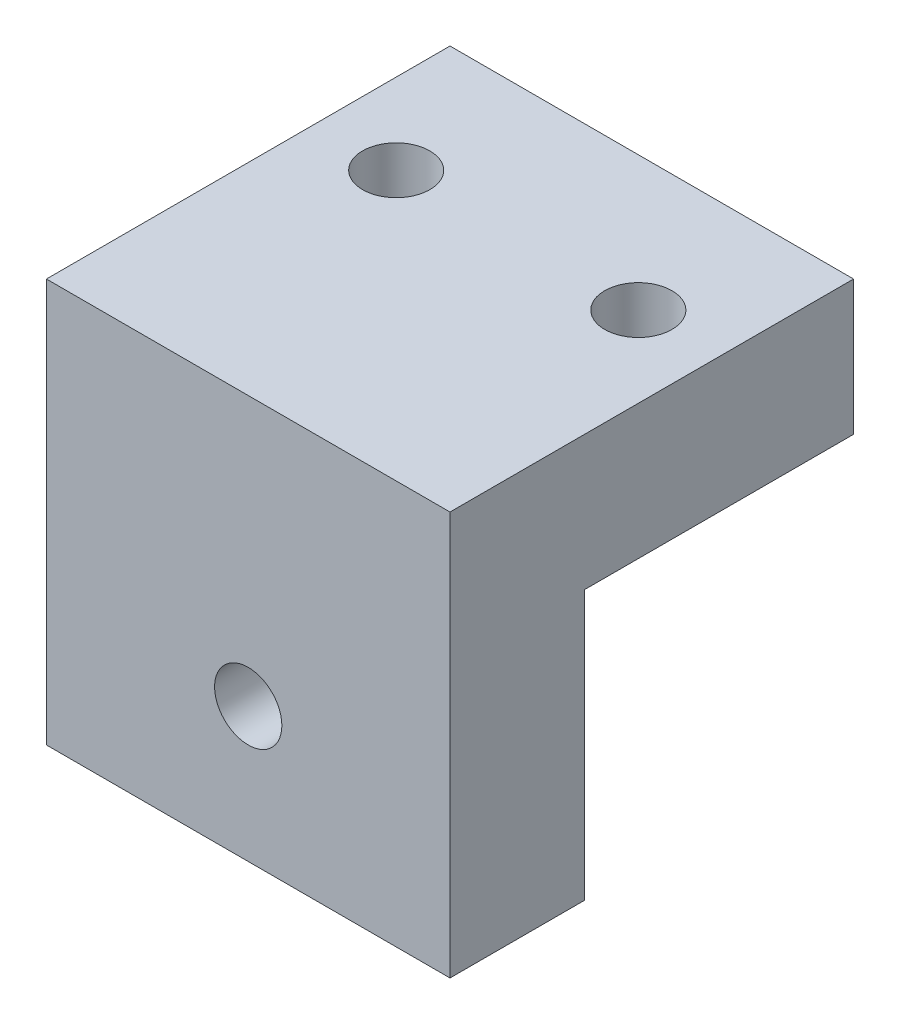
ISO-10303-21;
HEADER;
FILE_DESCRIPTION(('STEP AP214'),'2;1');
FILE_NAME('part.step','',(''),(''),'','','');
FILE_SCHEMA(('AUTOMOTIVE_DESIGN { 1 0 10303 214 1 1 1 1 }'));
ENDSEC;
DATA;
#1=APPLICATION_CONTEXT('core data for automotive mechanical design processes');
#2=APPLICATION_PROTOCOL_DEFINITION('international standard','automotive_design',2000,#1);
#3=PRODUCT_CONTEXT('',#1,'mechanical');
#4=PRODUCT('Part','Part','',(#3));
#5=PRODUCT_RELATED_PRODUCT_CATEGORY('part','',(#4));
#6=PRODUCT_DEFINITION_FORMATION('','',#4);
#7=PRODUCT_DEFINITION_CONTEXT('part definition',#1,'design');
#8=PRODUCT_DEFINITION('design','',#6,#7);
#9=PRODUCT_DEFINITION_SHAPE('','',#8);
#10=(LENGTH_UNIT() NAMED_UNIT(*) SI_UNIT(.MILLI.,.METRE.));
#11=(NAMED_UNIT(*) PLANE_ANGLE_UNIT() SI_UNIT($,.RADIAN.));
#12=(NAMED_UNIT(*) SI_UNIT($,.STERADIAN.) SOLID_ANGLE_UNIT());
#13=UNCERTAINTY_MEASURE_WITH_UNIT(LENGTH_MEASURE(1.E-05),#10,'distance_accuracy_value','');
#14=(GEOMETRIC_REPRESENTATION_CONTEXT(3) GLOBAL_UNCERTAINTY_ASSIGNED_CONTEXT((#13)) GLOBAL_UNIT_ASSIGNED_CONTEXT((#10,
#11,#12)) REPRESENTATION_CONTEXT('',''));
#15=CARTESIAN_POINT('',(0.,0.,0.));
#16=DIRECTION('',(0.,0.,1.));
#17=DIRECTION('',(1.,0.,0.));
#18=AXIS2_PLACEMENT_3D('',#15,#16,#17);
#19=CARTESIAN_POINT('',(0.,10.,0.));
#20=DIRECTION('',(1.,0.,0.));
#21=DIRECTION('',(0.,0.,1.));
#22=AXIS2_PLACEMENT_3D('',#19,#20,#21);
#23=PLANE('',#22);
#24=DIRECTION('',(0.,0.,-1.));
#25=VECTOR('',#24,1.);
#26=CARTESIAN_POINT('',(0.,0.,0.));
#27=LINE('',#26,#25);
#28=CARTESIAN_POINT('',(0.,0.,5.));
#29=VERTEX_POINT('',#28);
#30=CARTESIAN_POINT('',(0.,0.,0.));
#31=VERTEX_POINT('',#30);
#32=EDGE_CURVE('E99',#29,#31,#27,.T.);
#33=ORIENTED_EDGE('',*,*,#32,.F.);
#34=DIRECTION('',(0.,-1.,0.));
#35=VECTOR('',#34,1.);
#36=CARTESIAN_POINT('',(0.,10.,5.));
#37=LINE('',#36,#35);
#38=CARTESIAN_POINT('',(0.,15.,5.));
#39=VERTEX_POINT('',#38);
#40=EDGE_CURVE('E80',#39,#29,#37,.T.);
#41=ORIENTED_EDGE('',*,*,#40,.F.);
#42=DIRECTION('',(0.,0.,-1.));
#43=VECTOR('',#42,1.);
#44=CARTESIAN_POINT('',(0.,15.,5.));
#45=LINE('',#44,#43);
#46=CARTESIAN_POINT('',(0.,15.,-10.));
#47=VERTEX_POINT('',#46);
#48=EDGE_CURVE('E135',#39,#47,#45,.T.);
#49=ORIENTED_EDGE('',*,*,#48,.T.);
#50=DIRECTION('',(0.,-1.,0.));
#51=VECTOR('',#50,1.);
#52=CARTESIAN_POINT('',(0.,15.,-10.));
#53=LINE('',#52,#51);
#54=CARTESIAN_POINT('',(0.,10.,-10.));
#55=VERTEX_POINT('',#54);
#56=EDGE_CURVE('E133',#47,#55,#53,.T.);
#57=ORIENTED_EDGE('',*,*,#56,.T.);
#58=DIRECTION('',(0.,0.,-1.));
#59=VECTOR('',#58,1.);
#60=CARTESIAN_POINT('',(0.,10.,5.));
#61=LINE('',#60,#59);
#62=CARTESIAN_POINT('',(0.,10.,0.));
#63=VERTEX_POINT('',#62);
#64=EDGE_CURVE('E148',#63,#55,#61,.T.);
#65=ORIENTED_EDGE('',*,*,#64,.F.);
#66=DIRECTION('',(0.,-1.,0.));
#67=VECTOR('',#66,1.);
#68=CARTESIAN_POINT('',(0.,10.,0.));
#69=LINE('',#68,#67);
#70=EDGE_CURVE('E12',#63,#31,#69,.T.);
#71=ORIENTED_EDGE('',*,*,#70,.T.);
#72=EDGE_LOOP('',(#33,#41,#49,#57,#65,#71));
#73=FACE_BOUND('',#72,.T.);
#74=ADVANCED_FACE('F40',(#73),#23,.F.);
#75=CARTESIAN_POINT('',(0.,10.,0.));
#76=DIRECTION('',(0.,0.,1.));
#77=DIRECTION('',(-1.,0.,0.));
#78=AXIS2_PLACEMENT_3D('',#75,#76,#77);
#79=PLANE('',#78);
#80=CARTESIAN_POINT('',(7.5,5.,0.));
#81=DIRECTION('',(0.,0.,1.));
#82=DIRECTION('',(1.,0.,0.));
#83=AXIS2_PLACEMENT_3D('',#80,#81,#82);
#84=CIRCLE('',#83,1.25);
#85=CARTESIAN_POINT('',(8.75,5.,0.));
#86=VERTEX_POINT('',#85);
#87=EDGE_CURVE('E152',#86,#86,#84,.T.);
#88=ORIENTED_EDGE('',*,*,#87,.T.);
#89=EDGE_LOOP('',(#88));
#90=FACE_BOUND('',#89,.T.);
#91=DIRECTION('',(1.,0.,0.));
#92=VECTOR('',#91,1.);
#93=CARTESIAN_POINT('',(0.,0.,0.));
#94=LINE('',#93,#92);
#95=CARTESIAN_POINT('',(15.,0.,0.));
#96=VERTEX_POINT('',#95);
#97=EDGE_CURVE('E97',#31,#96,#94,.T.);
#98=ORIENTED_EDGE('',*,*,#97,.F.);
#99=ORIENTED_EDGE('',*,*,#70,.F.);
#100=DIRECTION('',(1.,0.,0.));
#101=VECTOR('',#100,1.);
#102=CARTESIAN_POINT('',(0.,10.,0.));
#103=LINE('',#102,#101);
#104=CARTESIAN_POINT('',(15.,10.,0.));
#105=VERTEX_POINT('',#104);
#106=EDGE_CURVE('E55',#63,#105,#103,.T.);
#107=ORIENTED_EDGE('',*,*,#106,.T.);
#108=DIRECTION('',(0.,-1.,0.));
#109=VECTOR('',#108,1.);
#110=CARTESIAN_POINT('',(15.,10.,0.));
#111=LINE('',#110,#109);
#112=EDGE_CURVE('E48',#105,#96,#111,.T.);
#113=ORIENTED_EDGE('',*,*,#112,.T.);
#114=EDGE_LOOP('',(#98,#99,#107,#113));
#115=FACE_BOUND('',#114,.T.);
#116=ADVANCED_FACE('F104',(#90,#115),#79,.F.);
#117=CARTESIAN_POINT('',(15.,10.,0.));
#118=DIRECTION('',(-1.,0.,0.));
#119=DIRECTION('',(0.,0.,-1.));
#120=AXIS2_PLACEMENT_3D('',#117,#118,#119);
#121=PLANE('',#120);
#122=DIRECTION('',(0.,0.,1.));
#123=VECTOR('',#122,1.);
#124=CARTESIAN_POINT('',(15.,0.,0.));
#125=LINE('',#124,#123);
#126=CARTESIAN_POINT('',(15.,0.,5.));
#127=VERTEX_POINT('',#126);
#128=EDGE_CURVE('E85',#96,#127,#125,.T.);
#129=ORIENTED_EDGE('',*,*,#128,.F.);
#130=ORIENTED_EDGE('',*,*,#112,.F.);
#131=DIRECTION('',(0.,0.,1.));
#132=VECTOR('',#131,1.);
#133=CARTESIAN_POINT('',(15.,10.,5.));
#134=LINE('',#133,#132);
#135=CARTESIAN_POINT('',(15.,10.,-10.));
#136=VERTEX_POINT('',#135);
#137=EDGE_CURVE('E107',#136,#105,#134,.T.);
#138=ORIENTED_EDGE('',*,*,#137,.F.);
#139=DIRECTION('',(0.,-1.,0.));
#140=VECTOR('',#139,1.);
#141=CARTESIAN_POINT('',(15.,15.,-10.));
#142=LINE('',#141,#140);
#143=CARTESIAN_POINT('',(15.,15.,-10.));
#144=VERTEX_POINT('',#143);
#145=EDGE_CURVE('E131',#144,#136,#142,.T.);
#146=ORIENTED_EDGE('',*,*,#145,.F.);
#147=DIRECTION('',(0.,0.,1.));
#148=VECTOR('',#147,1.);
#149=CARTESIAN_POINT('',(15.,15.,5.));
#150=LINE('',#149,#148);
#151=CARTESIAN_POINT('',(15.,15.,5.));
#152=VERTEX_POINT('',#151);
#153=EDGE_CURVE('E93',#144,#152,#150,.T.);
#154=ORIENTED_EDGE('',*,*,#153,.T.);
#155=DIRECTION('',(0.,-1.,0.));
#156=VECTOR('',#155,1.);
#157=CARTESIAN_POINT('',(15.,10.,5.));
#158=LINE('',#157,#156);
#159=EDGE_CURVE('E77',#152,#127,#158,.T.);
#160=ORIENTED_EDGE('',*,*,#159,.T.);
#161=EDGE_LOOP('',(#129,#130,#138,#146,#154,#160));
#162=FACE_BOUND('',#161,.T.);
#163=ADVANCED_FACE('F88',(#162),#121,.F.);
#164=CARTESIAN_POINT('',(0.,10.,5.));
#165=DIRECTION('',(0.,0.,-1.));
#166=DIRECTION('',(1.,0.,0.));
#167=AXIS2_PLACEMENT_3D('',#164,#165,#166);
#168=PLANE('',#167);
#169=CARTESIAN_POINT('',(7.5,5.,5.));
#170=DIRECTION('',(0.,0.,1.));
#171=DIRECTION('',(1.,0.,0.));
#172=AXIS2_PLACEMENT_3D('',#169,#170,#171);
#173=CIRCLE('',#172,1.25);
#174=CARTESIAN_POINT('',(8.75,5.,5.));
#175=VERTEX_POINT('',#174);
#176=EDGE_CURVE('E149',#175,#175,#173,.T.);
#177=ORIENTED_EDGE('',*,*,#176,.F.);
#178=EDGE_LOOP('',(#177));
#179=FACE_BOUND('',#178,.T.);
#180=DIRECTION('',(-1.,0.,0.));
#181=VECTOR('',#180,1.);
#182=CARTESIAN_POINT('',(0.,0.,5.));
#183=LINE('',#182,#181);
#184=EDGE_CURVE('E72',#127,#29,#183,.T.);
#185=ORIENTED_EDGE('',*,*,#184,.F.);
#186=ORIENTED_EDGE('',*,*,#159,.F.);
#187=DIRECTION('',(-1.,0.,0.));
#188=VECTOR('',#187,1.);
#189=CARTESIAN_POINT('',(0.,15.,5.));
#190=LINE('',#189,#188);
#191=EDGE_CURVE('E112',#152,#39,#190,.T.);
#192=ORIENTED_EDGE('',*,*,#191,.T.);
#193=ORIENTED_EDGE('',*,*,#40,.T.);
#194=EDGE_LOOP('',(#185,#186,#192,#193));
#195=FACE_BOUND('',#194,.T.);
#196=ADVANCED_FACE('F74',(#179,#195),#168,.F.);
#197=CARTESIAN_POINT('',(0.,0.,0.));
#198=DIRECTION('',(0.,-1.,0.));
#199=DIRECTION('',(0.,0.,1.));
#200=AXIS2_PLACEMENT_3D('',#197,#198,#199);
#201=PLANE('',#200);
#202=ORIENTED_EDGE('',*,*,#32,.T.);
#203=ORIENTED_EDGE('',*,*,#97,.T.);
#204=ORIENTED_EDGE('',*,*,#128,.T.);
#205=ORIENTED_EDGE('',*,*,#184,.T.);
#206=EDGE_LOOP('',(#202,#203,#204,#205));
#207=FACE_BOUND('',#206,.T.);
#208=ADVANCED_FACE('F96',(#207),#201,.T.);
#209=CARTESIAN_POINT('',(0.,10.,0.));
#210=DIRECTION('',(0.,1.,0.));
#211=DIRECTION('',(0.,0.,-1.));
#212=AXIS2_PLACEMENT_3D('',#209,#210,#211);
#213=PLANE('',#212);
#214=CARTESIAN_POINT('',(3.,10.,-5.));
#215=DIRECTION('',(0.,-1.,0.));
#216=DIRECTION('',(0.,0.,-1.));
#217=AXIS2_PLACEMENT_3D('',#214,#215,#216);
#218=CIRCLE('',#217,1.25);
#219=CARTESIAN_POINT('',(3.,10.,-6.25));
#220=VERTEX_POINT('',#219);
#221=EDGE_CURVE('E157',#220,#220,#218,.T.);
#222=ORIENTED_EDGE('',*,*,#221,.F.);
#223=EDGE_LOOP('',(#222));
#224=FACE_BOUND('',#223,.T.);
#225=CARTESIAN_POINT('',(12.,10.,-5.));
#226=DIRECTION('',(0.,-1.,0.));
#227=DIRECTION('',(0.,0.,-1.));
#228=AXIS2_PLACEMENT_3D('',#225,#226,#227);
#229=CIRCLE('',#228,1.25);
#230=CARTESIAN_POINT('',(12.,10.,-6.25));
#231=VERTEX_POINT('',#230);
#232=EDGE_CURVE('E162',#231,#231,#229,.T.);
#233=ORIENTED_EDGE('',*,*,#232,.F.);
#234=EDGE_LOOP('',(#233));
#235=FACE_BOUND('',#234,.T.);
#236=ORIENTED_EDGE('',*,*,#64,.T.);
#237=DIRECTION('',(1.,0.,0.));
#238=VECTOR('',#237,1.);
#239=CARTESIAN_POINT('',(0.,10.,-10.));
#240=LINE('',#239,#238);
#241=EDGE_CURVE('E121',#55,#136,#240,.T.);
#242=ORIENTED_EDGE('',*,*,#241,.T.);
#243=ORIENTED_EDGE('',*,*,#137,.T.);
#244=ORIENTED_EDGE('',*,*,#106,.F.);
#245=EDGE_LOOP('',(#236,#242,#243,#244));
#246=FACE_BOUND('',#245,.T.);
#247=ADVANCED_FACE('F174',(#224,#235,#246),#213,.F.);
#248=CARTESIAN_POINT('',(0.,15.,-10.));
#249=DIRECTION('',(0.,0.,1.));
#250=DIRECTION('',(-1.,0.,0.));
#251=AXIS2_PLACEMENT_3D('',#248,#249,#250);
#252=PLANE('',#251);
#253=ORIENTED_EDGE('',*,*,#241,.F.);
#254=ORIENTED_EDGE('',*,*,#56,.F.);
#255=DIRECTION('',(1.,0.,0.));
#256=VECTOR('',#255,1.);
#257=CARTESIAN_POINT('',(0.,15.,-10.));
#258=LINE('',#257,#256);
#259=EDGE_CURVE('E127',#47,#144,#258,.T.);
#260=ORIENTED_EDGE('',*,*,#259,.T.);
#261=ORIENTED_EDGE('',*,*,#145,.T.);
#262=EDGE_LOOP('',(#253,#254,#260,#261));
#263=FACE_BOUND('',#262,.T.);
#264=ADVANCED_FACE('F130',(#263),#252,.F.);
#265=CARTESIAN_POINT('',(0.,15.,0.));
#266=DIRECTION('',(0.,1.,0.));
#267=DIRECTION('',(0.,0.,-1.));
#268=AXIS2_PLACEMENT_3D('',#265,#266,#267);
#269=PLANE('',#268);
#270=CARTESIAN_POINT('',(3.,15.,-5.));
#271=DIRECTION('',(0.,-1.,0.));
#272=DIRECTION('',(0.,0.,-1.));
#273=AXIS2_PLACEMENT_3D('',#270,#271,#272);
#274=CIRCLE('',#273,1.25);
#275=CARTESIAN_POINT('',(3.,15.,-6.25));
#276=VERTEX_POINT('',#275);
#277=EDGE_CURVE('E165',#276,#276,#274,.T.);
#278=ORIENTED_EDGE('',*,*,#277,.T.);
#279=EDGE_LOOP('',(#278));
#280=FACE_BOUND('',#279,.T.);
#281=CARTESIAN_POINT('',(12.,15.,-5.));
#282=DIRECTION('',(0.,-1.,0.));
#283=DIRECTION('',(0.,0.,-1.));
#284=AXIS2_PLACEMENT_3D('',#281,#282,#283);
#285=CIRCLE('',#284,1.25);
#286=CARTESIAN_POINT('',(12.,15.,-6.25));
#287=VERTEX_POINT('',#286);
#288=EDGE_CURVE('E159',#287,#287,#285,.T.);
#289=ORIENTED_EDGE('',*,*,#288,.T.);
#290=EDGE_LOOP('',(#289));
#291=FACE_BOUND('',#290,.T.);
#292=ORIENTED_EDGE('',*,*,#48,.F.);
#293=ORIENTED_EDGE('',*,*,#191,.F.);
#294=ORIENTED_EDGE('',*,*,#153,.F.);
#295=ORIENTED_EDGE('',*,*,#259,.F.);
#296=EDGE_LOOP('',(#292,#293,#294,#295));
#297=FACE_BOUND('',#296,.T.);
#298=ADVANCED_FACE('F137',(#280,#291,#297),#269,.T.);
#299=CARTESIAN_POINT('',(7.5,5.,5.));
#300=DIRECTION('',(0.,0.,-1.));
#301=DIRECTION('',(1.,0.,0.));
#302=AXIS2_PLACEMENT_3D('',#299,#300,#301);
#303=CYLINDRICAL_SURFACE('',#302,1.25);
#304=ORIENTED_EDGE('',*,*,#176,.T.);
#305=EDGE_LOOP('',(#304));
#306=FACE_BOUND('',#305,.T.);
#307=ORIENTED_EDGE('',*,*,#87,.F.);
#308=EDGE_LOOP('',(#307));
#309=FACE_BOUND('',#308,.T.);
#310=ADVANCED_FACE('F183',(#306,#309),#303,.F.);
#311=CARTESIAN_POINT('',(12.,10.,-5.));
#312=DIRECTION('',(0.,1.,0.));
#313=DIRECTION('',(0.,0.,-1.));
#314=AXIS2_PLACEMENT_3D('',#311,#312,#313);
#315=CYLINDRICAL_SURFACE('',#314,1.25);
#316=ORIENTED_EDGE('',*,*,#232,.T.);
#317=EDGE_LOOP('',(#316));
#318=FACE_BOUND('',#317,.T.);
#319=ORIENTED_EDGE('',*,*,#288,.F.);
#320=EDGE_LOOP('',(#319));
#321=FACE_BOUND('',#320,.T.);
#322=ADVANCED_FACE('F180',(#318,#321),#315,.F.);
#323=CARTESIAN_POINT('',(3.,10.,-5.));
#324=DIRECTION('',(0.,1.,0.));
#325=DIRECTION('',(0.,0.,-1.));
#326=AXIS2_PLACEMENT_3D('',#323,#324,#325);
#327=CYLINDRICAL_SURFACE('',#326,1.25);
#328=ORIENTED_EDGE('',*,*,#221,.T.);
#329=EDGE_LOOP('',(#328));
#330=FACE_BOUND('',#329,.T.);
#331=ORIENTED_EDGE('',*,*,#277,.F.);
#332=EDGE_LOOP('',(#331));
#333=FACE_BOUND('',#332,.T.);
#334=ADVANCED_FACE('F171',(#330,#333),#327,.F.);
#335=CLOSED_SHELL('',(#74,#116,#163,#196,#208,#247,#264,#298,#310,#322,#334));
#336=MANIFOLD_SOLID_BREP('B2',#335);
#337=ADVANCED_BREP_SHAPE_REPRESENTATION('',(#18,#336),#14);
#338=SHAPE_DEFINITION_REPRESENTATION(#9,#337);
ENDSEC;
END-ISO-10303-21;
